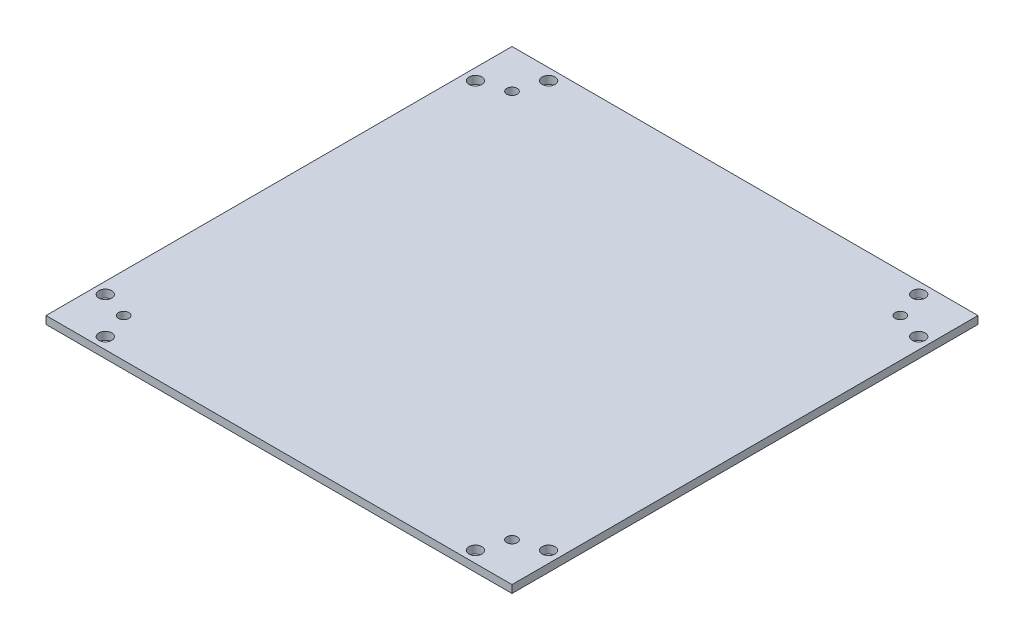
ISO-10303-21;
HEADER;
FILE_DESCRIPTION(('STEP AP214'),'2;1');
FILE_NAME('part.step','',(''),(''),'','','');
FILE_SCHEMA(('AUTOMOTIVE_DESIGN { 1 0 10303 214 1 1 1 1 }'));
ENDSEC;
DATA;
#1=APPLICATION_CONTEXT('core data for automotive mechanical design processes');
#2=APPLICATION_PROTOCOL_DEFINITION('international standard','automotive_design',2000,#1);
#3=PRODUCT_CONTEXT('',#1,'mechanical');
#4=PRODUCT('Part','Part','',(#3));
#5=PRODUCT_RELATED_PRODUCT_CATEGORY('part','',(#4));
#6=PRODUCT_DEFINITION_FORMATION('','',#4);
#7=PRODUCT_DEFINITION_CONTEXT('part definition',#1,'design');
#8=PRODUCT_DEFINITION('design','',#6,#7);
#9=PRODUCT_DEFINITION_SHAPE('','',#8);
#10=(LENGTH_UNIT() NAMED_UNIT(*) SI_UNIT(.MILLI.,.METRE.));
#11=(NAMED_UNIT(*) PLANE_ANGLE_UNIT() SI_UNIT($,.RADIAN.));
#12=(NAMED_UNIT(*) SI_UNIT($,.STERADIAN.) SOLID_ANGLE_UNIT());
#13=UNCERTAINTY_MEASURE_WITH_UNIT(LENGTH_MEASURE(1.E-05),#10,'distance_accuracy_value','');
#14=(GEOMETRIC_REPRESENTATION_CONTEXT(3) GLOBAL_UNCERTAINTY_ASSIGNED_CONTEXT((#13)) GLOBAL_UNIT_ASSIGNED_CONTEXT((#10,
#11,#12)) REPRESENTATION_CONTEXT('',''));
#15=CARTESIAN_POINT('',(0.,0.,0.));
#16=DIRECTION('',(0.,0.,1.));
#17=DIRECTION('',(1.,0.,0.));
#18=AXIS2_PLACEMENT_3D('',#15,#16,#17);
#19=CARTESIAN_POINT('',(0.,3.,0.));
#20=DIRECTION('',(0.,1.,0.));
#21=DIRECTION('',(0.,0.,1.));
#22=AXIS2_PLACEMENT_3D('',#19,#20,#21);
#23=PLANE('',#22);
#24=CARTESIAN_POINT('',(-71.4799999999956,3.,85.6200000000004));
#25=DIRECTION('',(0.,1.,0.));
#26=DIRECTION('',(0.,0.,1.));
#27=AXIS2_PLACEMENT_3D('',#24,#25,#26);
#28=CIRCLE('',#27,2.5000000000027);
#29=CARTESIAN_POINT('',(-71.4799999999956,3.,88.1200000000031));
#30=VERTEX_POINT('',#29);
#31=EDGE_CURVE('E170',#30,#30,#28,.T.);
#32=ORIENTED_EDGE('',*,*,#31,.F.);
#33=EDGE_LOOP('',(#32));
#34=FACE_BOUND('',#33,.T.);
#35=CARTESIAN_POINT('',(85.6200000000048,3.,71.479999999996));
#36=DIRECTION('',(0.,1.,0.));
#37=DIRECTION('',(0.,0.,1.));
#38=AXIS2_PLACEMENT_3D('',#35,#36,#37);
#39=CIRCLE('',#38,2.50000000000643);
#40=CARTESIAN_POINT('',(85.6200000000048,3.,73.9800000000024));
#41=VERTEX_POINT('',#40);
#42=EDGE_CURVE('E158',#41,#41,#39,.T.);
#43=ORIENTED_EDGE('',*,*,#42,.F.);
#44=EDGE_LOOP('',(#43));
#45=FACE_BOUND('',#44,.T.);
#46=CARTESIAN_POINT('',(71.4800000000004,3.,-85.6200000000044));
#47=DIRECTION('',(0.,1.,0.));
#48=DIRECTION('',(0.,0.,1.));
#49=AXIS2_PLACEMENT_3D('',#46,#47,#48);
#50=CIRCLE('',#49,2.50000000000444);
#51=CARTESIAN_POINT('',(71.4800000000004,3.,-83.12));
#52=VERTEX_POINT('',#51);
#53=EDGE_CURVE('E146',#52,#52,#50,.T.);
#54=ORIENTED_EDGE('',*,*,#53,.F.);
#55=EDGE_LOOP('',(#54));
#56=FACE_BOUND('',#55,.T.);
#57=CARTESIAN_POINT('',(-85.62,3.,-71.48));
#58=DIRECTION('',(0.,1.,0.));
#59=DIRECTION('',(0.,0.,1.));
#60=AXIS2_PLACEMENT_3D('',#57,#58,#59);
#61=CIRCLE('',#60,2.50000000000001);
#62=CARTESIAN_POINT('',(-85.62,3.,-68.98));
#63=VERTEX_POINT('',#62);
#64=EDGE_CURVE('E134',#63,#63,#61,.T.);
#65=ORIENTED_EDGE('',*,*,#64,.F.);
#66=EDGE_LOOP('',(#65));
#67=FACE_BOUND('',#66,.T.);
#68=CARTESIAN_POINT('',(-74.9999999999999,3.,75.));
#69=DIRECTION('',(0.,1.,0.));
#70=DIRECTION('',(0.,0.,1.));
#71=AXIS2_PLACEMENT_3D('',#68,#69,#70);
#72=CIRCLE('',#71,2.);
#73=CARTESIAN_POINT('',(-74.9999999999999,3.,77.));
#74=VERTEX_POINT('',#73);
#75=EDGE_CURVE('E122',#74,#74,#72,.T.);
#76=ORIENTED_EDGE('',*,*,#75,.F.);
#77=EDGE_LOOP('',(#76));
#78=FACE_BOUND('',#77,.T.);
#79=CARTESIAN_POINT('',(-75.,3.,-75.));
#80=DIRECTION('',(0.,1.,0.));
#81=DIRECTION('',(0.,0.,1.));
#82=AXIS2_PLACEMENT_3D('',#79,#80,#81);
#83=CIRCLE('',#82,2.);
#84=CARTESIAN_POINT('',(-75.,3.,-73.));
#85=VERTEX_POINT('',#84);
#86=EDGE_CURVE('E101',#85,#85,#83,.T.);
#87=ORIENTED_EDGE('',*,*,#86,.F.);
#88=EDGE_LOOP('',(#87));
#89=FACE_BOUND('',#88,.T.);
#90=DIRECTION('',(0.,0.,1.));
#91=VECTOR('',#90,1.);
#92=CARTESIAN_POINT('',(-90.,3.,90.));
#93=LINE('',#92,#91);
#94=CARTESIAN_POINT('',(-90.,3.,-90.));
#95=VERTEX_POINT('',#94);
#96=CARTESIAN_POINT('',(-90.,3.,90.));
#97=VERTEX_POINT('',#96);
#98=EDGE_CURVE('E86',#95,#97,#93,.T.);
#99=ORIENTED_EDGE('',*,*,#98,.T.);
#100=DIRECTION('',(1.,0.,0.));
#101=VECTOR('',#100,1.);
#102=CARTESIAN_POINT('',(90.,3.,90.));
#103=LINE('',#102,#101);
#104=CARTESIAN_POINT('',(90.,3.,90.));
#105=VERTEX_POINT('',#104);
#106=EDGE_CURVE('E81',#97,#105,#103,.T.);
#107=ORIENTED_EDGE('',*,*,#106,.T.);
#108=DIRECTION('',(0.,0.,-1.));
#109=VECTOR('',#108,1.);
#110=CARTESIAN_POINT('',(90.,3.,90.));
#111=LINE('',#110,#109);
#112=CARTESIAN_POINT('',(90.,3.,-90.));
#113=VERTEX_POINT('',#112);
#114=EDGE_CURVE('E84',#105,#113,#111,.T.);
#115=ORIENTED_EDGE('',*,*,#114,.T.);
#116=DIRECTION('',(-1.,0.,0.));
#117=VECTOR('',#116,1.);
#118=CARTESIAN_POINT('',(90.,3.,-90.));
#119=LINE('',#118,#117);
#120=EDGE_CURVE('E51',#113,#95,#119,.T.);
#121=ORIENTED_EDGE('',*,*,#120,.T.);
#122=EDGE_LOOP('',(#99,#107,#115,#121));
#123=FACE_BOUND('',#122,.T.);
#124=CARTESIAN_POINT('',(75.,3.,-75.));
#125=DIRECTION('',(0.,1.,0.));
#126=DIRECTION('',(0.,0.,1.));
#127=AXIS2_PLACEMENT_3D('',#124,#125,#126);
#128=CIRCLE('',#127,2.);
#129=CARTESIAN_POINT('',(75.,3.,-73.));
#130=VERTEX_POINT('',#129);
#131=EDGE_CURVE('E116',#130,#130,#128,.T.);
#132=ORIENTED_EDGE('',*,*,#131,.F.);
#133=EDGE_LOOP('',(#132));
#134=FACE_BOUND('',#133,.T.);
#135=CARTESIAN_POINT('',(75.,3.,75.));
#136=DIRECTION('',(0.,1.,0.));
#137=DIRECTION('',(0.,0.,1.));
#138=AXIS2_PLACEMENT_3D('',#135,#136,#137);
#139=CIRCLE('',#138,2.);
#140=CARTESIAN_POINT('',(75.,3.,77.));
#141=VERTEX_POINT('',#140);
#142=EDGE_CURVE('E128',#141,#141,#139,.T.);
#143=ORIENTED_EDGE('',*,*,#142,.F.);
#144=EDGE_LOOP('',(#143));
#145=FACE_BOUND('',#144,.T.);
#146=CARTESIAN_POINT('',(-71.477864376269,3.,-85.6221356237309));
#147=DIRECTION('',(0.,1.,0.));
#148=DIRECTION('',(0.,0.,1.));
#149=AXIS2_PLACEMENT_3D('',#146,#147,#148);
#150=CIRCLE('',#149,2.5);
#151=CARTESIAN_POINT('',(-71.477864376269,3.,-83.1221356237309));
#152=VERTEX_POINT('',#151);
#153=EDGE_CURVE('E140',#152,#152,#150,.T.);
#154=ORIENTED_EDGE('',*,*,#153,.F.);
#155=EDGE_LOOP('',(#154));
#156=FACE_BOUND('',#155,.T.);
#157=CARTESIAN_POINT('',(85.6221356237314,3.,-71.4778643762735));
#158=DIRECTION('',(0.,1.,0.));
#159=DIRECTION('',(0.,0.,1.));
#160=AXIS2_PLACEMENT_3D('',#157,#158,#159);
#161=CIRCLE('',#160,2.5);
#162=CARTESIAN_POINT('',(85.6221356237314,3.,-68.9778643762735));
#163=VERTEX_POINT('',#162);
#164=EDGE_CURVE('E152',#163,#163,#161,.T.);
#165=ORIENTED_EDGE('',*,*,#164,.F.);
#166=EDGE_LOOP('',(#165));
#167=FACE_BOUND('',#166,.T.);
#168=CARTESIAN_POINT('',(71.4778643762739,3.,85.6221356237269));
#169=DIRECTION('',(0.,1.,0.));
#170=DIRECTION('',(0.,0.,1.));
#171=AXIS2_PLACEMENT_3D('',#168,#169,#170);
#172=CIRCLE('',#171,2.50000000000001);
#173=CARTESIAN_POINT('',(71.4778643762739,3.,88.1221356237269));
#174=VERTEX_POINT('',#173);
#175=EDGE_CURVE('E164',#174,#174,#172,.T.);
#176=ORIENTED_EDGE('',*,*,#175,.F.);
#177=EDGE_LOOP('',(#176));
#178=FACE_BOUND('',#177,.T.);
#179=CARTESIAN_POINT('',(-85.6221356237265,3.,71.4778643762695));
#180=DIRECTION('',(0.,1.,0.));
#181=DIRECTION('',(0.,0.,1.));
#182=AXIS2_PLACEMENT_3D('',#179,#180,#181);
#183=CIRCLE('',#182,2.50000000000001);
#184=CARTESIAN_POINT('',(-85.6221356237265,3.,73.9778643762695));
#185=VERTEX_POINT('',#184);
#186=EDGE_CURVE('E176',#185,#185,#183,.T.);
#187=ORIENTED_EDGE('',*,*,#186,.F.);
#188=EDGE_LOOP('',(#187));
#189=FACE_BOUND('',#188,.T.);
#190=ADVANCED_FACE('F34',(#34,#45,#56,#67,#78,#89,#123,#134,#145,#156,#167,#178,#189),#23,.T.);
#191=CARTESIAN_POINT('',(0.,0.,0.));
#192=DIRECTION('',(0.,1.,0.));
#193=DIRECTION('',(0.,0.,1.));
#194=AXIS2_PLACEMENT_3D('',#191,#192,#193);
#195=PLANE('',#194);
#196=DIRECTION('',(0.,0.,1.));
#197=VECTOR('',#196,1.);
#198=CARTESIAN_POINT('',(-90.,0.,90.));
#199=LINE('',#198,#197);
#200=CARTESIAN_POINT('',(-90.,0.,-90.));
#201=VERTEX_POINT('',#200);
#202=CARTESIAN_POINT('',(-90.,0.,90.));
#203=VERTEX_POINT('',#202);
#204=EDGE_CURVE('E98',#201,#203,#199,.T.);
#205=ORIENTED_EDGE('',*,*,#204,.F.);
#206=DIRECTION('',(-1.,0.,0.));
#207=VECTOR('',#206,1.);
#208=CARTESIAN_POINT('',(90.,0.,-90.));
#209=LINE('',#208,#207);
#210=CARTESIAN_POINT('',(90.,0.,-90.));
#211=VERTEX_POINT('',#210);
#212=EDGE_CURVE('E74',#211,#201,#209,.T.);
#213=ORIENTED_EDGE('',*,*,#212,.F.);
#214=DIRECTION('',(0.,0.,-1.));
#215=VECTOR('',#214,1.);
#216=CARTESIAN_POINT('',(90.,0.,90.));
#217=LINE('',#216,#215);
#218=CARTESIAN_POINT('',(90.,0.,90.));
#219=VERTEX_POINT('',#218);
#220=EDGE_CURVE('E68',#219,#211,#217,.T.);
#221=ORIENTED_EDGE('',*,*,#220,.F.);
#222=DIRECTION('',(1.,0.,0.));
#223=VECTOR('',#222,1.);
#224=CARTESIAN_POINT('',(90.,0.,90.));
#225=LINE('',#224,#223);
#226=EDGE_CURVE('E90',#203,#219,#225,.T.);
#227=ORIENTED_EDGE('',*,*,#226,.F.);
#228=EDGE_LOOP('',(#205,#213,#221,#227));
#229=FACE_BOUND('',#228,.T.);
#230=CARTESIAN_POINT('',(-75.,0.,-75.));
#231=DIRECTION('',(0.,1.,0.));
#232=DIRECTION('',(0.,0.,1.));
#233=AXIS2_PLACEMENT_3D('',#230,#231,#232);
#234=CIRCLE('',#233,2.);
#235=CARTESIAN_POINT('',(-75.,0.,-73.));
#236=VERTEX_POINT('',#235);
#237=EDGE_CURVE('E113',#236,#236,#234,.T.);
#238=ORIENTED_EDGE('',*,*,#237,.T.);
#239=EDGE_LOOP('',(#238));
#240=FACE_BOUND('',#239,.T.);
#241=CARTESIAN_POINT('',(75.,0.,-75.));
#242=DIRECTION('',(0.,1.,0.));
#243=DIRECTION('',(0.,0.,1.));
#244=AXIS2_PLACEMENT_3D('',#241,#242,#243);
#245=CIRCLE('',#244,2.);
#246=CARTESIAN_POINT('',(75.,0.,-73.));
#247=VERTEX_POINT('',#246);
#248=EDGE_CURVE('E119',#247,#247,#245,.T.);
#249=ORIENTED_EDGE('',*,*,#248,.T.);
#250=EDGE_LOOP('',(#249));
#251=FACE_BOUND('',#250,.T.);
#252=CARTESIAN_POINT('',(-74.9999999999999,0.,75.));
#253=DIRECTION('',(0.,1.,0.));
#254=DIRECTION('',(0.,0.,1.));
#255=AXIS2_PLACEMENT_3D('',#252,#253,#254);
#256=CIRCLE('',#255,2.);
#257=CARTESIAN_POINT('',(-74.9999999999999,0.,77.));
#258=VERTEX_POINT('',#257);
#259=EDGE_CURVE('E125',#258,#258,#256,.T.);
#260=ORIENTED_EDGE('',*,*,#259,.T.);
#261=EDGE_LOOP('',(#260));
#262=FACE_BOUND('',#261,.T.);
#263=CARTESIAN_POINT('',(75.,0.,75.));
#264=DIRECTION('',(0.,1.,0.));
#265=DIRECTION('',(0.,0.,1.));
#266=AXIS2_PLACEMENT_3D('',#263,#264,#265);
#267=CIRCLE('',#266,2.);
#268=CARTESIAN_POINT('',(75.,0.,77.));
#269=VERTEX_POINT('',#268);
#270=EDGE_CURVE('E131',#269,#269,#267,.T.);
#271=ORIENTED_EDGE('',*,*,#270,.T.);
#272=EDGE_LOOP('',(#271));
#273=FACE_BOUND('',#272,.T.);
#274=CARTESIAN_POINT('',(-85.62,0.,-71.48));
#275=DIRECTION('',(0.,1.,0.));
#276=DIRECTION('',(0.,0.,1.));
#277=AXIS2_PLACEMENT_3D('',#274,#275,#276);
#278=CIRCLE('',#277,2.50000000000001);
#279=CARTESIAN_POINT('',(-85.62,0.,-68.98));
#280=VERTEX_POINT('',#279);
#281=EDGE_CURVE('E137',#280,#280,#278,.T.);
#282=ORIENTED_EDGE('',*,*,#281,.T.);
#283=EDGE_LOOP('',(#282));
#284=FACE_BOUND('',#283,.T.);
#285=CARTESIAN_POINT('',(-71.477864376269,0.,-85.6221356237309));
#286=DIRECTION('',(0.,1.,0.));
#287=DIRECTION('',(0.,0.,1.));
#288=AXIS2_PLACEMENT_3D('',#285,#286,#287);
#289=CIRCLE('',#288,2.5);
#290=CARTESIAN_POINT('',(-71.477864376269,0.,-83.1221356237309));
#291=VERTEX_POINT('',#290);
#292=EDGE_CURVE('E143',#291,#291,#289,.T.);
#293=ORIENTED_EDGE('',*,*,#292,.T.);
#294=EDGE_LOOP('',(#293));
#295=FACE_BOUND('',#294,.T.);
#296=CARTESIAN_POINT('',(71.4800000000004,0.,-85.6200000000044));
#297=DIRECTION('',(0.,1.,0.));
#298=DIRECTION('',(0.,0.,1.));
#299=AXIS2_PLACEMENT_3D('',#296,#297,#298);
#300=CIRCLE('',#299,2.50000000000444);
#301=CARTESIAN_POINT('',(71.4800000000004,0.,-83.12));
#302=VERTEX_POINT('',#301);
#303=EDGE_CURVE('E149',#302,#302,#300,.T.);
#304=ORIENTED_EDGE('',*,*,#303,.T.);
#305=EDGE_LOOP('',(#304));
#306=FACE_BOUND('',#305,.T.);
#307=CARTESIAN_POINT('',(85.6221356237314,0.,-71.4778643762735));
#308=DIRECTION('',(0.,1.,0.));
#309=DIRECTION('',(0.,0.,1.));
#310=AXIS2_PLACEMENT_3D('',#307,#308,#309);
#311=CIRCLE('',#310,2.5);
#312=CARTESIAN_POINT('',(85.6221356237314,0.,-68.9778643762735));
#313=VERTEX_POINT('',#312);
#314=EDGE_CURVE('E155',#313,#313,#311,.T.);
#315=ORIENTED_EDGE('',*,*,#314,.T.);
#316=EDGE_LOOP('',(#315));
#317=FACE_BOUND('',#316,.T.);
#318=CARTESIAN_POINT('',(85.6200000000048,0.,71.479999999996));
#319=DIRECTION('',(0.,1.,0.));
#320=DIRECTION('',(0.,0.,1.));
#321=AXIS2_PLACEMENT_3D('',#318,#319,#320);
#322=CIRCLE('',#321,2.50000000000643);
#323=CARTESIAN_POINT('',(85.6200000000048,0.,73.9800000000024));
#324=VERTEX_POINT('',#323);
#325=EDGE_CURVE('E161',#324,#324,#322,.T.);
#326=ORIENTED_EDGE('',*,*,#325,.T.);
#327=EDGE_LOOP('',(#326));
#328=FACE_BOUND('',#327,.T.);
#329=CARTESIAN_POINT('',(71.4778643762739,0.,85.6221356237269));
#330=DIRECTION('',(0.,1.,0.));
#331=DIRECTION('',(0.,0.,1.));
#332=AXIS2_PLACEMENT_3D('',#329,#330,#331);
#333=CIRCLE('',#332,2.50000000000001);
#334=CARTESIAN_POINT('',(71.4778643762739,0.,88.1221356237269));
#335=VERTEX_POINT('',#334);
#336=EDGE_CURVE('E167',#335,#335,#333,.T.);
#337=ORIENTED_EDGE('',*,*,#336,.T.);
#338=EDGE_LOOP('',(#337));
#339=FACE_BOUND('',#338,.T.);
#340=CARTESIAN_POINT('',(-71.4799999999956,0.,85.6200000000004));
#341=DIRECTION('',(0.,1.,0.));
#342=DIRECTION('',(0.,0.,1.));
#343=AXIS2_PLACEMENT_3D('',#340,#341,#342);
#344=CIRCLE('',#343,2.5000000000027);
#345=CARTESIAN_POINT('',(-71.4799999999956,0.,88.1200000000031));
#346=VERTEX_POINT('',#345);
#347=EDGE_CURVE('E173',#346,#346,#344,.T.);
#348=ORIENTED_EDGE('',*,*,#347,.T.);
#349=EDGE_LOOP('',(#348));
#350=FACE_BOUND('',#349,.T.);
#351=CARTESIAN_POINT('',(-85.6221356237265,0.,71.4778643762695));
#352=DIRECTION('',(0.,1.,0.));
#353=DIRECTION('',(0.,0.,1.));
#354=AXIS2_PLACEMENT_3D('',#351,#352,#353);
#355=CIRCLE('',#354,2.50000000000001);
#356=CARTESIAN_POINT('',(-85.6221356237265,0.,73.9778643762695));
#357=VERTEX_POINT('',#356);
#358=EDGE_CURVE('E179',#357,#357,#355,.T.);
#359=ORIENTED_EDGE('',*,*,#358,.T.);
#360=EDGE_LOOP('',(#359));
#361=FACE_BOUND('',#360,.T.);
#362=ADVANCED_FACE('F109',(#229,#240,#251,#262,#273,#284,#295,#306,#317,#328,#339,#350,#361),
#195,.F.);
#363=CARTESIAN_POINT('',(-90.,3.,90.));
#364=DIRECTION('',(1.,0.,0.));
#365=DIRECTION('',(0.,0.,-1.));
#366=AXIS2_PLACEMENT_3D('',#363,#364,#365);
#367=PLANE('',#366);
#368=ORIENTED_EDGE('',*,*,#204,.T.);
#369=DIRECTION('',(0.,-1.,0.));
#370=VECTOR('',#369,1.);
#371=CARTESIAN_POINT('',(-90.,3.,90.));
#372=LINE('',#371,#370);
#373=EDGE_CURVE('E11',#97,#203,#372,.T.);
#374=ORIENTED_EDGE('',*,*,#373,.F.);
#375=ORIENTED_EDGE('',*,*,#98,.F.);
#376=DIRECTION('',(0.,-1.,0.));
#377=VECTOR('',#376,1.);
#378=CARTESIAN_POINT('',(-90.,3.,-90.));
#379=LINE('',#378,#377);
#380=EDGE_CURVE('E94',#95,#201,#379,.T.);
#381=ORIENTED_EDGE('',*,*,#380,.T.);
#382=EDGE_LOOP('',(#368,#374,#375,#381));
#383=FACE_BOUND('',#382,.T.);
#384=ADVANCED_FACE('F36',(#383),#367,.F.);
#385=CARTESIAN_POINT('',(90.,3.,90.));
#386=DIRECTION('',(0.,0.,-1.));
#387=DIRECTION('',(-1.,0.,0.));
#388=AXIS2_PLACEMENT_3D('',#385,#386,#387);
#389=PLANE('',#388);
#390=ORIENTED_EDGE('',*,*,#226,.T.);
#391=DIRECTION('',(0.,-1.,0.));
#392=VECTOR('',#391,1.);
#393=CARTESIAN_POINT('',(90.,3.,90.));
#394=LINE('',#393,#392);
#395=EDGE_CURVE('E43',#105,#219,#394,.T.);
#396=ORIENTED_EDGE('',*,*,#395,.F.);
#397=ORIENTED_EDGE('',*,*,#106,.F.);
#398=ORIENTED_EDGE('',*,*,#373,.T.);
#399=EDGE_LOOP('',(#390,#396,#397,#398));
#400=FACE_BOUND('',#399,.T.);
#401=ADVANCED_FACE('F89',(#400),#389,.F.);
#402=CARTESIAN_POINT('',(90.,3.,90.));
#403=DIRECTION('',(-1.,0.,0.));
#404=DIRECTION('',(0.,0.,1.));
#405=AXIS2_PLACEMENT_3D('',#402,#403,#404);
#406=PLANE('',#405);
#407=ORIENTED_EDGE('',*,*,#220,.T.);
#408=DIRECTION('',(0.,-1.,0.));
#409=VECTOR('',#408,1.);
#410=CARTESIAN_POINT('',(90.,3.,-90.));
#411=LINE('',#410,#409);
#412=EDGE_CURVE('E91',#113,#211,#411,.T.);
#413=ORIENTED_EDGE('',*,*,#412,.F.);
#414=ORIENTED_EDGE('',*,*,#114,.F.);
#415=ORIENTED_EDGE('',*,*,#395,.T.);
#416=EDGE_LOOP('',(#407,#413,#414,#415));
#417=FACE_BOUND('',#416,.T.);
#418=ADVANCED_FACE('F92',(#417),#406,.F.);
#419=CARTESIAN_POINT('',(90.,3.,-90.));
#420=DIRECTION('',(0.,0.,1.));
#421=DIRECTION('',(1.,0.,0.));
#422=AXIS2_PLACEMENT_3D('',#419,#420,#421);
#423=PLANE('',#422);
#424=ORIENTED_EDGE('',*,*,#212,.T.);
#425=ORIENTED_EDGE('',*,*,#380,.F.);
#426=ORIENTED_EDGE('',*,*,#120,.F.);
#427=ORIENTED_EDGE('',*,*,#412,.T.);
#428=EDGE_LOOP('',(#424,#425,#426,#427));
#429=FACE_BOUND('',#428,.T.);
#430=ADVANCED_FACE('F106',(#429),#423,.F.);
#431=CARTESIAN_POINT('',(-75.,3.,-75.));
#432=DIRECTION('',(0.,-1.,0.));
#433=DIRECTION('',(0.,0.,-1.));
#434=AXIS2_PLACEMENT_3D('',#431,#432,#433);
#435=CYLINDRICAL_SURFACE('',#434,2.);
#436=ORIENTED_EDGE('',*,*,#86,.T.);
#437=EDGE_LOOP('',(#436));
#438=FACE_BOUND('',#437,.T.);
#439=ORIENTED_EDGE('',*,*,#237,.F.);
#440=EDGE_LOOP('',(#439));
#441=FACE_BOUND('',#440,.T.);
#442=ADVANCED_FACE('F198',(#438,#441),#435,.F.);
#443=CARTESIAN_POINT('',(75.,3.,-75.));
#444=DIRECTION('',(0.,-1.,0.));
#445=DIRECTION('',(0.,0.,-1.));
#446=AXIS2_PLACEMENT_3D('',#443,#444,#445);
#447=CYLINDRICAL_SURFACE('',#446,2.);
#448=ORIENTED_EDGE('',*,*,#131,.T.);
#449=EDGE_LOOP('',(#448));
#450=FACE_BOUND('',#449,.T.);
#451=ORIENTED_EDGE('',*,*,#248,.F.);
#452=EDGE_LOOP('',(#451));
#453=FACE_BOUND('',#452,.T.);
#454=ADVANCED_FACE('F244',(#450,#453),#447,.F.);
#455=CARTESIAN_POINT('',(-74.9999999999999,3.,75.));
#456=DIRECTION('',(0.,-1.,0.));
#457=DIRECTION('',(0.,0.,-1.));
#458=AXIS2_PLACEMENT_3D('',#455,#456,#457);
#459=CYLINDRICAL_SURFACE('',#458,2.);
#460=ORIENTED_EDGE('',*,*,#75,.T.);
#461=EDGE_LOOP('',(#460));
#462=FACE_BOUND('',#461,.T.);
#463=ORIENTED_EDGE('',*,*,#259,.F.);
#464=EDGE_LOOP('',(#463));
#465=FACE_BOUND('',#464,.T.);
#466=ADVANCED_FACE('F252',(#462,#465),#459,.F.);
#467=CARTESIAN_POINT('',(75.,3.,75.));
#468=DIRECTION('',(0.,-1.,0.));
#469=DIRECTION('',(0.,0.,-1.));
#470=AXIS2_PLACEMENT_3D('',#467,#468,#469);
#471=CYLINDRICAL_SURFACE('',#470,2.);
#472=ORIENTED_EDGE('',*,*,#142,.T.);
#473=EDGE_LOOP('',(#472));
#474=FACE_BOUND('',#473,.T.);
#475=ORIENTED_EDGE('',*,*,#270,.F.);
#476=EDGE_LOOP('',(#475));
#477=FACE_BOUND('',#476,.T.);
#478=ADVANCED_FACE('F260',(#474,#477),#471,.F.);
#479=CARTESIAN_POINT('',(-85.62,3.,-71.48));
#480=DIRECTION('',(0.,-1.,0.));
#481=DIRECTION('',(0.,0.,-1.));
#482=AXIS2_PLACEMENT_3D('',#479,#480,#481);
#483=CYLINDRICAL_SURFACE('',#482,2.50000000000001);
#484=ORIENTED_EDGE('',*,*,#64,.T.);
#485=EDGE_LOOP('',(#484));
#486=FACE_BOUND('',#485,.T.);
#487=ORIENTED_EDGE('',*,*,#281,.F.);
#488=EDGE_LOOP('',(#487));
#489=FACE_BOUND('',#488,.T.);
#490=ADVANCED_FACE('F269',(#486,#489),#483,.F.);
#491=CARTESIAN_POINT('',(-71.477864376269,3.,-85.6221356237309));
#492=DIRECTION('',(0.,-1.,0.));
#493=DIRECTION('',(0.,0.,-1.));
#494=AXIS2_PLACEMENT_3D('',#491,#492,#493);
#495=CYLINDRICAL_SURFACE('',#494,2.5);
#496=ORIENTED_EDGE('',*,*,#153,.T.);
#497=EDGE_LOOP('',(#496));
#498=FACE_BOUND('',#497,.T.);
#499=ORIENTED_EDGE('',*,*,#292,.F.);
#500=EDGE_LOOP('',(#499));
#501=FACE_BOUND('',#500,.T.);
#502=ADVANCED_FACE('F278',(#498,#501),#495,.F.);
#503=CARTESIAN_POINT('',(71.4800000000004,3.,-85.6200000000044));
#504=DIRECTION('',(0.,-1.,0.));
#505=DIRECTION('',(0.,0.,-1.));
#506=AXIS2_PLACEMENT_3D('',#503,#504,#505);
#507=CYLINDRICAL_SURFACE('',#506,2.50000000000444);
#508=ORIENTED_EDGE('',*,*,#53,.T.);
#509=EDGE_LOOP('',(#508));
#510=FACE_BOUND('',#509,.T.);
#511=ORIENTED_EDGE('',*,*,#303,.F.);
#512=EDGE_LOOP('',(#511));
#513=FACE_BOUND('',#512,.T.);
#514=ADVANCED_FACE('F287',(#510,#513),#507,.F.);
#515=CARTESIAN_POINT('',(85.6221356237314,3.,-71.4778643762735));
#516=DIRECTION('',(0.,-1.,0.));
#517=DIRECTION('',(0.,0.,-1.));
#518=AXIS2_PLACEMENT_3D('',#515,#516,#517);
#519=CYLINDRICAL_SURFACE('',#518,2.5);
#520=ORIENTED_EDGE('',*,*,#164,.T.);
#521=EDGE_LOOP('',(#520));
#522=FACE_BOUND('',#521,.T.);
#523=ORIENTED_EDGE('',*,*,#314,.F.);
#524=EDGE_LOOP('',(#523));
#525=FACE_BOUND('',#524,.T.);
#526=ADVANCED_FACE('F296',(#522,#525),#519,.F.);
#527=CARTESIAN_POINT('',(85.6200000000048,3.,71.479999999996));
#528=DIRECTION('',(0.,-1.,0.));
#529=DIRECTION('',(0.,0.,-1.));
#530=AXIS2_PLACEMENT_3D('',#527,#528,#529);
#531=CYLINDRICAL_SURFACE('',#530,2.50000000000643);
#532=ORIENTED_EDGE('',*,*,#42,.T.);
#533=EDGE_LOOP('',(#532));
#534=FACE_BOUND('',#533,.T.);
#535=ORIENTED_EDGE('',*,*,#325,.F.);
#536=EDGE_LOOP('',(#535));
#537=FACE_BOUND('',#536,.T.);
#538=ADVANCED_FACE('F305',(#534,#537),#531,.F.);
#539=CARTESIAN_POINT('',(71.4778643762739,3.,85.6221356237269));
#540=DIRECTION('',(0.,-1.,0.));
#541=DIRECTION('',(0.,0.,-1.));
#542=AXIS2_PLACEMENT_3D('',#539,#540,#541);
#543=CYLINDRICAL_SURFACE('',#542,2.50000000000001);
#544=ORIENTED_EDGE('',*,*,#175,.T.);
#545=EDGE_LOOP('',(#544));
#546=FACE_BOUND('',#545,.T.);
#547=ORIENTED_EDGE('',*,*,#336,.F.);
#548=EDGE_LOOP('',(#547));
#549=FACE_BOUND('',#548,.T.);
#550=ADVANCED_FACE('F314',(#546,#549),#543,.F.);
#551=CARTESIAN_POINT('',(-71.4799999999956,3.,85.6200000000004));
#552=DIRECTION('',(0.,-1.,0.));
#553=DIRECTION('',(0.,0.,-1.));
#554=AXIS2_PLACEMENT_3D('',#551,#552,#553);
#555=CYLINDRICAL_SURFACE('',#554,2.5000000000027);
#556=ORIENTED_EDGE('',*,*,#31,.T.);
#557=EDGE_LOOP('',(#556));
#558=FACE_BOUND('',#557,.T.);
#559=ORIENTED_EDGE('',*,*,#347,.F.);
#560=EDGE_LOOP('',(#559));
#561=FACE_BOUND('',#560,.T.);
#562=ADVANCED_FACE('F323',(#558,#561),#555,.F.);
#563=CARTESIAN_POINT('',(-85.6221356237265,3.,71.4778643762695));
#564=DIRECTION('',(0.,-1.,0.));
#565=DIRECTION('',(0.,0.,-1.));
#566=AXIS2_PLACEMENT_3D('',#563,#564,#565);
#567=CYLINDRICAL_SURFACE('',#566,2.50000000000001);
#568=ORIENTED_EDGE('',*,*,#186,.T.);
#569=EDGE_LOOP('',(#568));
#570=FACE_BOUND('',#569,.T.);
#571=ORIENTED_EDGE('',*,*,#358,.F.);
#572=EDGE_LOOP('',(#571));
#573=FACE_BOUND('',#572,.T.);
#574=ADVANCED_FACE('F185',(#570,#573),#567,.F.);
#575=CLOSED_SHELL('',(#190,#362,#384,#401,#418,#430,#442,#454,#466,#478,#490,#502,#514,#526,
#538,#550,#562,#574));
#576=MANIFOLD_SOLID_BREP('B2',#575);
#577=ADVANCED_BREP_SHAPE_REPRESENTATION('',(#18,#576),#14);
#578=SHAPE_DEFINITION_REPRESENTATION(#9,#577);
ENDSEC;
END-ISO-10303-21;
